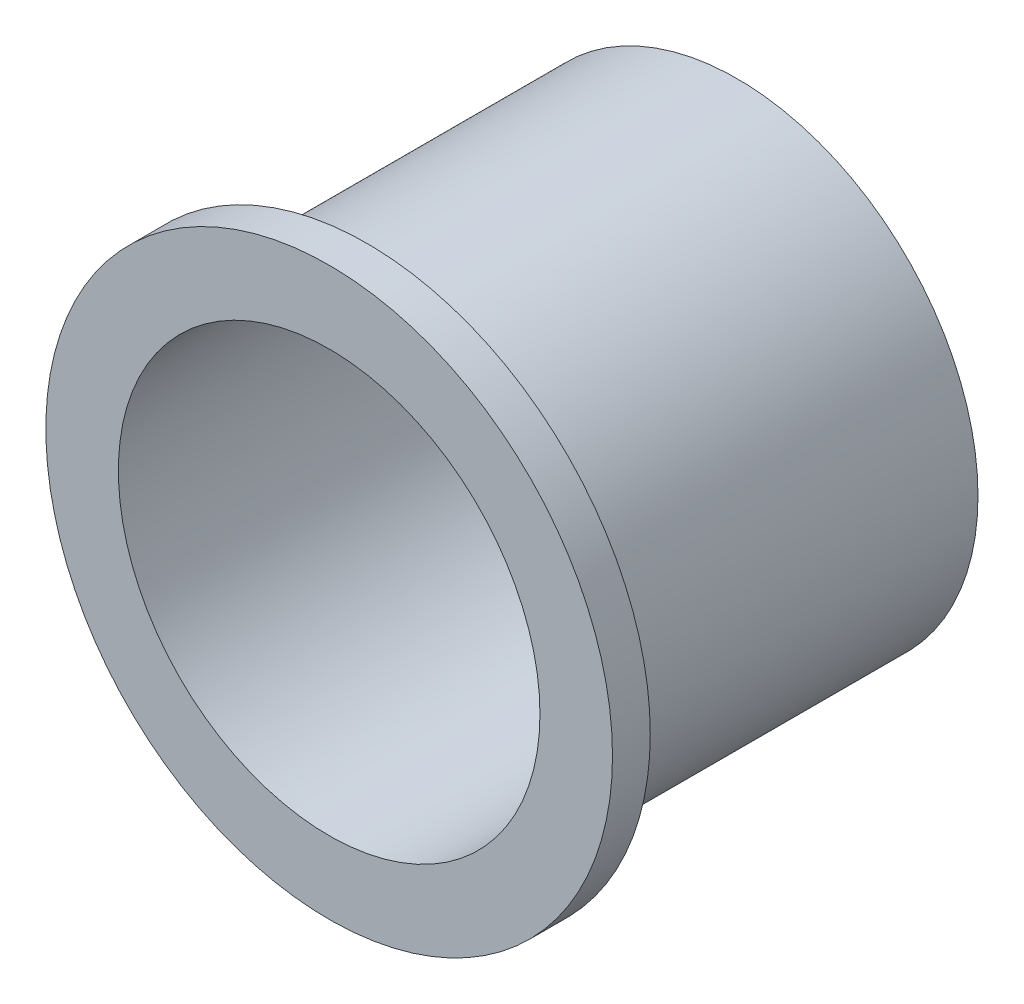
ISO-10303-21;
HEADER;
FILE_DESCRIPTION(('STEP AP214'),'2;1');
FILE_NAME('part.step','',(''),(''),'','','');
FILE_SCHEMA(('AUTOMOTIVE_DESIGN { 1 0 10303 214 1 1 1 1 }'));
ENDSEC;
DATA;
#1=APPLICATION_CONTEXT('core data for automotive mechanical design processes');
#2=APPLICATION_PROTOCOL_DEFINITION('international standard','automotive_design',2000,#1);
#3=PRODUCT_CONTEXT('',#1,'mechanical');
#4=PRODUCT('Part','Part','',(#3));
#5=PRODUCT_RELATED_PRODUCT_CATEGORY('part','',(#4));
#6=PRODUCT_DEFINITION_FORMATION('','',#4);
#7=PRODUCT_DEFINITION_CONTEXT('part definition',#1,'design');
#8=PRODUCT_DEFINITION('design','',#6,#7);
#9=PRODUCT_DEFINITION_SHAPE('','',#8);
#10=(LENGTH_UNIT() NAMED_UNIT(*) SI_UNIT(.MILLI.,.METRE.));
#11=(NAMED_UNIT(*) PLANE_ANGLE_UNIT() SI_UNIT($,.RADIAN.));
#12=(NAMED_UNIT(*) SI_UNIT($,.STERADIAN.) SOLID_ANGLE_UNIT());
#13=UNCERTAINTY_MEASURE_WITH_UNIT(LENGTH_MEASURE(1.E-05),#10,'distance_accuracy_value','');
#14=(GEOMETRIC_REPRESENTATION_CONTEXT(3) GLOBAL_UNCERTAINTY_ASSIGNED_CONTEXT((#13)) GLOBAL_UNIT_ASSIGNED_CONTEXT((#10,
#11,#12)) REPRESENTATION_CONTEXT('',''));
#15=CARTESIAN_POINT('',(0.,0.,0.));
#16=DIRECTION('',(0.,0.,1.));
#17=DIRECTION('',(1.,0.,0.));
#18=AXIS2_PLACEMENT_3D('',#15,#16,#17);
#19=CARTESIAN_POINT('',(0.,0.,0.));
#20=DIRECTION('',(0.,0.,1.));
#21=DIRECTION('',(1.,0.,0.));
#22=AXIS2_PLACEMENT_3D('',#19,#20,#21);
#23=CYLINDRICAL_SURFACE('',#22,190.5);
#24=CARTESIAN_POINT('',(0.,0.,0.));
#25=DIRECTION('',(0.,0.,1.));
#26=DIRECTION('',(1.,0.,0.));
#27=AXIS2_PLACEMENT_3D('',#24,#25,#26);
#28=CIRCLE('',#27,190.5);
#29=CARTESIAN_POINT('',(190.5,0.,0.));
#30=VERTEX_POINT('',#29);
#31=EDGE_CURVE('E10',#30,#30,#28,.T.);
#32=ORIENTED_EDGE('',*,*,#31,.F.);
#33=EDGE_LOOP('',(#32));
#34=FACE_BOUND('',#33,.T.);
#35=CARTESIAN_POINT('',(0.,0.,-25.4));
#36=DIRECTION('',(0.,0.,1.));
#37=DIRECTION('',(1.,0.,0.));
#38=AXIS2_PLACEMENT_3D('',#35,#36,#37);
#39=CIRCLE('',#38,190.5);
#40=CARTESIAN_POINT('',(190.5,0.,-25.4));
#41=VERTEX_POINT('',#40);
#42=EDGE_CURVE('E67',#41,#41,#39,.T.);
#43=ORIENTED_EDGE('',*,*,#42,.T.);
#44=EDGE_LOOP('',(#43));
#45=FACE_BOUND('',#44,.T.);
#46=ADVANCED_FACE('F40',(#34,#45),#23,.T.);
#47=CARTESIAN_POINT('',(0.,190.5,0.));
#48=DIRECTION('',(0.,0.,-1.));
#49=DIRECTION('',(-1.,0.,0.));
#50=AXIS2_PLACEMENT_3D('',#47,#48,#49);
#51=PLANE('',#50);
#52=CARTESIAN_POINT('',(0.,0.,0.));
#53=DIRECTION('',(0.,0.,1.));
#54=DIRECTION('',(1.,0.,0.));
#55=AXIS2_PLACEMENT_3D('',#52,#53,#54);
#56=CIRCLE('',#55,141.732);
#57=CARTESIAN_POINT('',(141.732,0.,0.));
#58=VERTEX_POINT('',#57);
#59=EDGE_CURVE('E47',#58,#58,#56,.T.);
#60=ORIENTED_EDGE('',*,*,#59,.F.);
#61=EDGE_LOOP('',(#60));
#62=FACE_BOUND('',#61,.T.);
#63=ORIENTED_EDGE('',*,*,#31,.T.);
#64=EDGE_LOOP('',(#63));
#65=FACE_BOUND('',#64,.T.);
#66=ADVANCED_FACE('F93',(#62,#65),#51,.F.);
#67=CARTESIAN_POINT('',(0.,0.,0.));
#68=DIRECTION('',(0.,0.,1.));
#69=DIRECTION('',(1.,0.,0.));
#70=AXIS2_PLACEMENT_3D('',#67,#68,#69);
#71=CYLINDRICAL_SURFACE('',#70,141.732);
#72=CARTESIAN_POINT('',(0.,0.,-274.32));
#73=DIRECTION('',(0.,0.,1.));
#74=DIRECTION('',(1.,0.,0.));
#75=AXIS2_PLACEMENT_3D('',#72,#73,#74);
#76=CIRCLE('',#75,141.732);
#77=CARTESIAN_POINT('',(141.732,0.,-274.32));
#78=VERTEX_POINT('',#77);
#79=EDGE_CURVE('E52',#78,#78,#76,.T.);
#80=ORIENTED_EDGE('',*,*,#79,.F.);
#81=EDGE_LOOP('',(#80));
#82=FACE_BOUND('',#81,.T.);
#83=ORIENTED_EDGE('',*,*,#59,.T.);
#84=EDGE_LOOP('',(#83));
#85=FACE_BOUND('',#84,.T.);
#86=ADVANCED_FACE('F88',(#82,#85),#71,.F.);
#87=CARTESIAN_POINT('',(0.,141.732,-274.32));
#88=DIRECTION('',(0.,0.,1.));
#89=DIRECTION('',(1.,0.,0.));
#90=AXIS2_PLACEMENT_3D('',#87,#88,#89);
#91=PLANE('',#90);
#92=CARTESIAN_POINT('',(0.,0.,-274.32));
#93=DIRECTION('',(0.,0.,1.));
#94=DIRECTION('',(1.,0.,0.));
#95=AXIS2_PLACEMENT_3D('',#92,#93,#94);
#96=CIRCLE('',#95,161.925);
#97=CARTESIAN_POINT('',(161.925,0.,-274.32));
#98=VERTEX_POINT('',#97);
#99=EDGE_CURVE('E57',#98,#98,#96,.T.);
#100=ORIENTED_EDGE('',*,*,#99,.F.);
#101=EDGE_LOOP('',(#100));
#102=FACE_BOUND('',#101,.T.);
#103=ORIENTED_EDGE('',*,*,#79,.T.);
#104=EDGE_LOOP('',(#103));
#105=FACE_BOUND('',#104,.T.);
#106=ADVANCED_FACE('F82',(#102,#105),#91,.F.);
#107=CARTESIAN_POINT('',(0.,0.,0.));
#108=DIRECTION('',(0.,0.,1.));
#109=DIRECTION('',(1.,0.,0.));
#110=AXIS2_PLACEMENT_3D('',#107,#108,#109);
#111=CYLINDRICAL_SURFACE('',#110,161.925);
#112=CARTESIAN_POINT('',(0.,0.,-25.4));
#113=DIRECTION('',(0.,0.,1.));
#114=DIRECTION('',(1.,0.,0.));
#115=AXIS2_PLACEMENT_3D('',#112,#113,#114);
#116=CIRCLE('',#115,161.925);
#117=CARTESIAN_POINT('',(161.925,0.,-25.4));
#118=VERTEX_POINT('',#117);
#119=EDGE_CURVE('E63',#118,#118,#116,.T.);
#120=ORIENTED_EDGE('',*,*,#119,.F.);
#121=EDGE_LOOP('',(#120));
#122=FACE_BOUND('',#121,.T.);
#123=ORIENTED_EDGE('',*,*,#99,.T.);
#124=EDGE_LOOP('',(#123));
#125=FACE_BOUND('',#124,.T.);
#126=ADVANCED_FACE('F76',(#122,#125),#111,.T.);
#127=CARTESIAN_POINT('',(0.,161.925,-25.4));
#128=DIRECTION('',(0.,0.,1.));
#129=DIRECTION('',(1.,0.,0.));
#130=AXIS2_PLACEMENT_3D('',#127,#128,#129);
#131=PLANE('',#130);
#132=ORIENTED_EDGE('',*,*,#42,.F.);
#133=EDGE_LOOP('',(#132));
#134=FACE_BOUND('',#133,.T.);
#135=ORIENTED_EDGE('',*,*,#119,.T.);
#136=EDGE_LOOP('',(#135));
#137=FACE_BOUND('',#136,.T.);
#138=ADVANCED_FACE('F73',(#134,#137),#131,.F.);
#139=CLOSED_SHELL('',(#46,#66,#86,#106,#126,#138));
#140=MANIFOLD_SOLID_BREP('B2',#139);
#141=ADVANCED_BREP_SHAPE_REPRESENTATION('',(#18,#140),#14);
#142=SHAPE_DEFINITION_REPRESENTATION(#9,#141);
ENDSEC;
END-ISO-10303-21;
